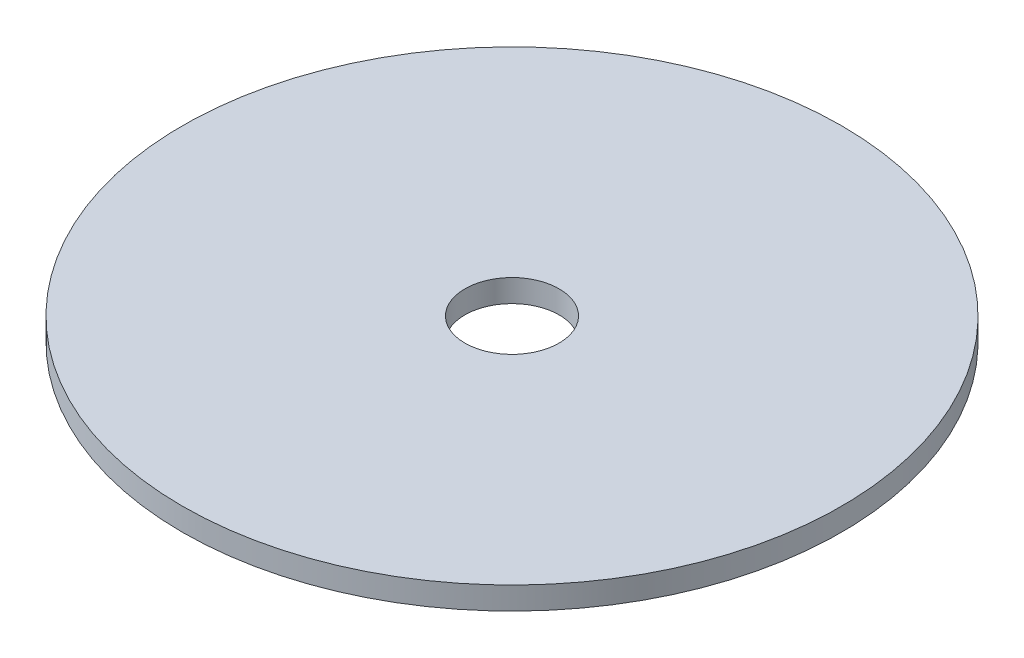
ISO-10303-21;
HEADER;
FILE_DESCRIPTION(('STEP AP214'),'2;1');
FILE_NAME('part.step','',(''),(''),'','','');
FILE_SCHEMA(('AUTOMOTIVE_DESIGN { 1 0 10303 214 1 1 1 1 }'));
ENDSEC;
DATA;
#1=APPLICATION_CONTEXT('core data for automotive mechanical design processes');
#2=APPLICATION_PROTOCOL_DEFINITION('international standard','automotive_design',2000,#1);
#3=PRODUCT_CONTEXT('',#1,'mechanical');
#4=PRODUCT('Part','Part','',(#3));
#5=PRODUCT_RELATED_PRODUCT_CATEGORY('part','',(#4));
#6=PRODUCT_DEFINITION_FORMATION('','',#4);
#7=PRODUCT_DEFINITION_CONTEXT('part definition',#1,'design');
#8=PRODUCT_DEFINITION('design','',#6,#7);
#9=PRODUCT_DEFINITION_SHAPE('','',#8);
#10=(LENGTH_UNIT() NAMED_UNIT(*) SI_UNIT(.MILLI.,.METRE.));
#11=(NAMED_UNIT(*) PLANE_ANGLE_UNIT() SI_UNIT($,.RADIAN.));
#12=(NAMED_UNIT(*) SI_UNIT($,.STERADIAN.) SOLID_ANGLE_UNIT());
#13=UNCERTAINTY_MEASURE_WITH_UNIT(LENGTH_MEASURE(1.E-05),#10,'distance_accuracy_value','');
#14=(GEOMETRIC_REPRESENTATION_CONTEXT(3) GLOBAL_UNCERTAINTY_ASSIGNED_CONTEXT((#13)) GLOBAL_UNIT_ASSIGNED_CONTEXT((#10,
#11,#12)) REPRESENTATION_CONTEXT('',''));
#15=CARTESIAN_POINT('',(0.,0.,0.));
#16=DIRECTION('',(0.,0.,1.));
#17=DIRECTION('',(1.,0.,0.));
#18=AXIS2_PLACEMENT_3D('',#15,#16,#17);
#19=CARTESIAN_POINT('',(0.,6.,0.));
#20=DIRECTION('',(0.,-1.,0.));
#21=DIRECTION('',(0.,0.,-1.));
#22=AXIS2_PLACEMENT_3D('',#19,#20,#21);
#23=CYLINDRICAL_SURFACE('',#22,87.5);
#24=CARTESIAN_POINT('',(0.,6.,0.));
#25=DIRECTION('',(0.,1.,0.));
#26=DIRECTION('',(0.,0.,1.));
#27=AXIS2_PLACEMENT_3D('',#24,#25,#26);
#28=CIRCLE('',#27,87.5);
#29=CARTESIAN_POINT('',(0.,6.,87.5));
#30=VERTEX_POINT('',#29);
#31=EDGE_CURVE('E10',#30,#30,#28,.T.);
#32=ORIENTED_EDGE('',*,*,#31,.F.);
#33=EDGE_LOOP('',(#32));
#34=FACE_BOUND('',#33,.T.);
#35=CARTESIAN_POINT('',(0.,0.,0.));
#36=DIRECTION('',(0.,1.,0.));
#37=DIRECTION('',(0.,0.,1.));
#38=AXIS2_PLACEMENT_3D('',#35,#36,#37);
#39=CIRCLE('',#38,87.5);
#40=CARTESIAN_POINT('',(0.,0.,87.5));
#41=VERTEX_POINT('',#40);
#42=EDGE_CURVE('E37',#41,#41,#39,.T.);
#43=ORIENTED_EDGE('',*,*,#42,.T.);
#44=EDGE_LOOP('',(#43));
#45=FACE_BOUND('',#44,.T.);
#46=ADVANCED_FACE('F40',(#34,#45),#23,.T.);
#47=CARTESIAN_POINT('',(0.,6.,0.));
#48=DIRECTION('',(0.,1.,0.));
#49=DIRECTION('',(0.,0.,1.));
#50=AXIS2_PLACEMENT_3D('',#47,#48,#49);
#51=PLANE('',#50);
#52=CARTESIAN_POINT('',(0.,6.,0.));
#53=DIRECTION('',(0.,1.,0.));
#54=DIRECTION('',(0.,0.,1.));
#55=AXIS2_PLACEMENT_3D('',#52,#53,#54);
#56=CIRCLE('',#55,12.5);
#57=CARTESIAN_POINT('',(0.,6.,12.5));
#58=VERTEX_POINT('',#57);
#59=EDGE_CURVE('E50',#58,#58,#56,.T.);
#60=ORIENTED_EDGE('',*,*,#59,.F.);
#61=EDGE_LOOP('',(#60));
#62=FACE_BOUND('',#61,.T.);
#63=ORIENTED_EDGE('',*,*,#31,.T.);
#64=EDGE_LOOP('',(#63));
#65=FACE_BOUND('',#64,.T.);
#66=ADVANCED_FACE('F59',(#62,#65),#51,.T.);
#67=CARTESIAN_POINT('',(0.,0.,0.));
#68=DIRECTION('',(0.,1.,0.));
#69=DIRECTION('',(0.,0.,1.));
#70=AXIS2_PLACEMENT_3D('',#67,#68,#69);
#71=PLANE('',#70);
#72=CARTESIAN_POINT('',(0.,0.,0.));
#73=DIRECTION('',(0.,1.,0.));
#74=DIRECTION('',(0.,0.,1.));
#75=AXIS2_PLACEMENT_3D('',#72,#73,#74);
#76=CIRCLE('',#75,12.5);
#77=CARTESIAN_POINT('',(0.,0.,12.5));
#78=VERTEX_POINT('',#77);
#79=EDGE_CURVE('E47',#78,#78,#76,.T.);
#80=ORIENTED_EDGE('',*,*,#79,.T.);
#81=EDGE_LOOP('',(#80));
#82=FACE_BOUND('',#81,.T.);
#83=ORIENTED_EDGE('',*,*,#42,.F.);
#84=EDGE_LOOP('',(#83));
#85=FACE_BOUND('',#84,.T.);
#86=ADVANCED_FACE('F58',(#82,#85),#71,.F.);
#87=CARTESIAN_POINT('',(0.,6.,0.));
#88=DIRECTION('',(0.,-1.,0.));
#89=DIRECTION('',(0.,0.,-1.));
#90=AXIS2_PLACEMENT_3D('',#87,#88,#89);
#91=CYLINDRICAL_SURFACE('',#90,12.5);
#92=ORIENTED_EDGE('',*,*,#59,.T.);
#93=EDGE_LOOP('',(#92));
#94=FACE_BOUND('',#93,.T.);
#95=ORIENTED_EDGE('',*,*,#79,.F.);
#96=EDGE_LOOP('',(#95));
#97=FACE_BOUND('',#96,.T.);
#98=ADVANCED_FACE('F54',(#94,#97),#91,.F.);
#99=CLOSED_SHELL('',(#46,#66,#86,#98));
#100=MANIFOLD_SOLID_BREP('B2',#99);
#101=ADVANCED_BREP_SHAPE_REPRESENTATION('',(#18,#100),#14);
#102=SHAPE_DEFINITION_REPRESENTATION(#9,#101);
ENDSEC;
END-ISO-10303-21;
